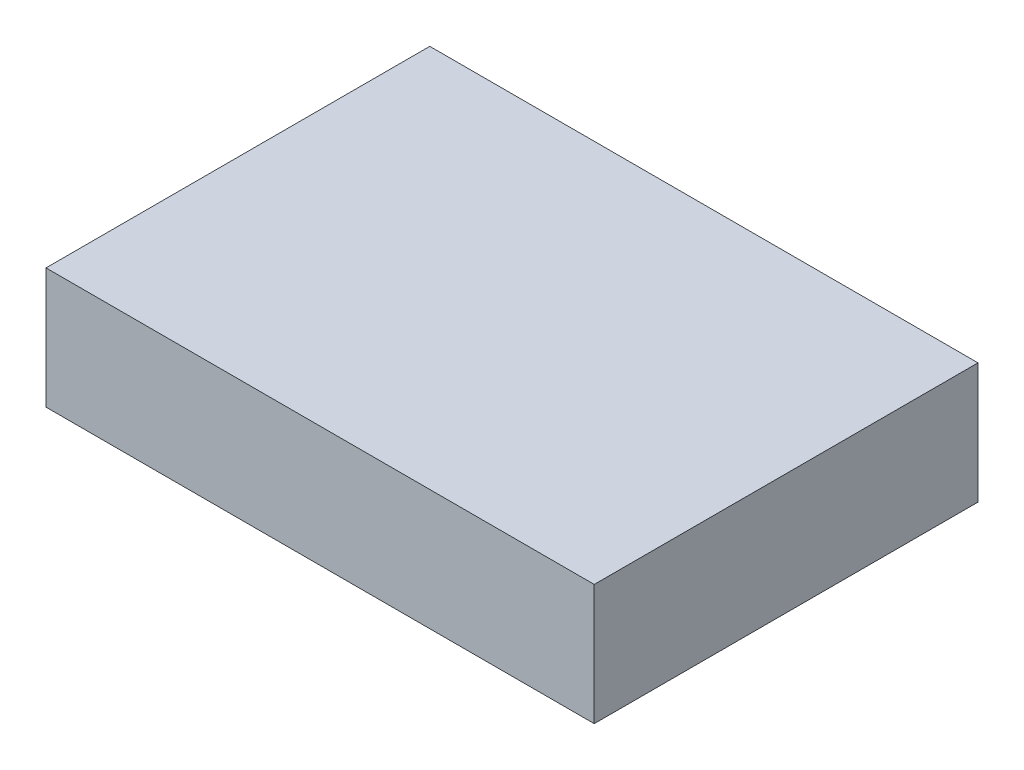
ISO-10303-21;
HEADER;
FILE_DESCRIPTION(('STEP AP214'),'2;1');
FILE_NAME('part.step','',(''),(''),'','','');
FILE_SCHEMA(('AUTOMOTIVE_DESIGN { 1 0 10303 214 1 1 1 1 }'));
ENDSEC;
DATA;
#1=APPLICATION_CONTEXT('core data for automotive mechanical design processes');
#2=APPLICATION_PROTOCOL_DEFINITION('international standard','automotive_design',2000,#1);
#3=PRODUCT_CONTEXT('',#1,'mechanical');
#4=PRODUCT('Part','Part','',(#3));
#5=PRODUCT_RELATED_PRODUCT_CATEGORY('part','',(#4));
#6=PRODUCT_DEFINITION_FORMATION('','',#4);
#7=PRODUCT_DEFINITION_CONTEXT('part definition',#1,'design');
#8=PRODUCT_DEFINITION('design','',#6,#7);
#9=PRODUCT_DEFINITION_SHAPE('','',#8);
#10=(LENGTH_UNIT() NAMED_UNIT(*) SI_UNIT(.MILLI.,.METRE.));
#11=(NAMED_UNIT(*) PLANE_ANGLE_UNIT() SI_UNIT($,.RADIAN.));
#12=(NAMED_UNIT(*) SI_UNIT($,.STERADIAN.) SOLID_ANGLE_UNIT());
#13=UNCERTAINTY_MEASURE_WITH_UNIT(LENGTH_MEASURE(1.E-05),#10,'distance_accuracy_value','');
#14=(GEOMETRIC_REPRESENTATION_CONTEXT(3) GLOBAL_UNCERTAINTY_ASSIGNED_CONTEXT((#13)) GLOBAL_UNIT_ASSIGNED_CONTEXT((#10,
#11,#12)) REPRESENTATION_CONTEXT('',''));
#15=CARTESIAN_POINT('',(0.,0.,0.));
#16=DIRECTION('',(0.,0.,1.));
#17=DIRECTION('',(1.,0.,0.));
#18=AXIS2_PLACEMENT_3D('',#15,#16,#17);
#19=CARTESIAN_POINT('',(-34.2523178699718,11.,-17.005122858167));
#20=DIRECTION('',(1.,0.,0.));
#21=DIRECTION('',(0.,0.,-1.));
#22=AXIS2_PLACEMENT_3D('',#19,#20,#21);
#23=PLANE('',#22);
#24=DIRECTION('',(0.,0.,1.));
#25=VECTOR('',#24,1.);
#26=CARTESIAN_POINT('',(-34.2523178699718,0.,-17.005122858167));
#27=LINE('',#26,#25);
#28=CARTESIAN_POINT('',(-34.2523178699718,0.,-17.005122858167));
#29=VERTEX_POINT('',#28);
#30=CARTESIAN_POINT('',(-34.2523178699718,0.,17.994877141833));
#31=VERTEX_POINT('',#30);
#32=EDGE_CURVE('E110',#29,#31,#27,.T.);
#33=ORIENTED_EDGE('',*,*,#32,.T.);
#34=DIRECTION('',(0.,-1.,0.));
#35=VECTOR('',#34,1.);
#36=CARTESIAN_POINT('',(-34.2523178699718,11.,17.994877141833));
#37=LINE('',#36,#35);
#38=CARTESIAN_POINT('',(-34.2523178699718,11.,17.994877141833));
#39=VERTEX_POINT('',#38);
#40=EDGE_CURVE('E11',#39,#31,#37,.T.);
#41=ORIENTED_EDGE('',*,*,#40,.F.);
#42=DIRECTION('',(0.,0.,1.));
#43=VECTOR('',#42,1.);
#44=CARTESIAN_POINT('',(-34.2523178699718,11.,-17.005122858167));
#45=LINE('',#44,#43);
#46=CARTESIAN_POINT('',(-34.2523178699718,11.,-17.005122858167));
#47=VERTEX_POINT('',#46);
#48=EDGE_CURVE('E94',#47,#39,#45,.T.);
#49=ORIENTED_EDGE('',*,*,#48,.F.);
#50=DIRECTION('',(0.,-1.,0.));
#51=VECTOR('',#50,1.);
#52=CARTESIAN_POINT('',(-34.2523178699718,11.,-17.005122858167));
#53=LINE('',#52,#51);
#54=EDGE_CURVE('E106',#47,#29,#53,.T.);
#55=ORIENTED_EDGE('',*,*,#54,.T.);
#56=EDGE_LOOP('',(#33,#41,#49,#55));
#57=FACE_BOUND('',#56,.T.);
#58=ADVANCED_FACE('F42',(#57),#23,.F.);
#59=CARTESIAN_POINT('',(-34.2523178699718,11.,17.994877141833));
#60=DIRECTION('',(0.,0.,-1.));
#61=DIRECTION('',(-1.,0.,0.));
#62=AXIS2_PLACEMENT_3D('',#59,#60,#61);
#63=PLANE('',#62);
#64=DIRECTION('',(1.,0.,0.));
#65=VECTOR('',#64,1.);
#66=CARTESIAN_POINT('',(-34.2523178699718,0.,17.994877141833));
#67=LINE('',#66,#65);
#68=CARTESIAN_POINT('',(15.7476821300282,0.,17.994877141833));
#69=VERTEX_POINT('',#68);
#70=EDGE_CURVE('E99',#31,#69,#67,.T.);
#71=ORIENTED_EDGE('',*,*,#70,.T.);
#72=DIRECTION('',(0.,-1.,0.));
#73=VECTOR('',#72,1.);
#74=CARTESIAN_POINT('',(15.7476821300282,11.,17.994877141833));
#75=LINE('',#74,#73);
#76=CARTESIAN_POINT('',(15.7476821300282,11.,17.994877141833));
#77=VERTEX_POINT('',#76);
#78=EDGE_CURVE('E51',#77,#69,#75,.T.);
#79=ORIENTED_EDGE('',*,*,#78,.F.);
#80=DIRECTION('',(1.,0.,0.));
#81=VECTOR('',#80,1.);
#82=CARTESIAN_POINT('',(-34.2523178699718,11.,17.994877141833));
#83=LINE('',#82,#81);
#84=EDGE_CURVE('E89',#39,#77,#83,.T.);
#85=ORIENTED_EDGE('',*,*,#84,.F.);
#86=ORIENTED_EDGE('',*,*,#40,.T.);
#87=EDGE_LOOP('',(#71,#79,#85,#86));
#88=FACE_BOUND('',#87,.T.);
#89=ADVANCED_FACE('F98',(#88),#63,.F.);
#90=CARTESIAN_POINT('',(15.7476821300282,11.,-17.005122858167));
#91=DIRECTION('',(-1.,0.,0.));
#92=DIRECTION('',(0.,0.,1.));
#93=AXIS2_PLACEMENT_3D('',#90,#91,#92);
#94=PLANE('',#93);
#95=DIRECTION('',(0.,0.,-1.));
#96=VECTOR('',#95,1.);
#97=CARTESIAN_POINT('',(15.7476821300282,0.,-17.005122858167));
#98=LINE('',#97,#96);
#99=CARTESIAN_POINT('',(15.7476821300282,0.,-17.005122858167));
#100=VERTEX_POINT('',#99);
#101=EDGE_CURVE('E76',#69,#100,#98,.T.);
#102=ORIENTED_EDGE('',*,*,#101,.T.);
#103=DIRECTION('',(0.,-1.,0.));
#104=VECTOR('',#103,1.);
#105=CARTESIAN_POINT('',(15.7476821300282,11.,-17.005122858167));
#106=LINE('',#105,#104);
#107=CARTESIAN_POINT('',(15.7476821300282,11.,-17.005122858167));
#108=VERTEX_POINT('',#107);
#109=EDGE_CURVE('E101',#108,#100,#106,.T.);
#110=ORIENTED_EDGE('',*,*,#109,.F.);
#111=DIRECTION('',(0.,0.,-1.));
#112=VECTOR('',#111,1.);
#113=CARTESIAN_POINT('',(15.7476821300282,11.,-17.005122858167));
#114=LINE('',#113,#112);
#115=EDGE_CURVE('E92',#77,#108,#114,.T.);
#116=ORIENTED_EDGE('',*,*,#115,.F.);
#117=ORIENTED_EDGE('',*,*,#78,.T.);
#118=EDGE_LOOP('',(#102,#110,#116,#117));
#119=FACE_BOUND('',#118,.T.);
#120=ADVANCED_FACE('F102',(#119),#94,.F.);
#121=CARTESIAN_POINT('',(-34.2523178699718,11.,-17.005122858167));
#122=DIRECTION('',(0.,0.,1.));
#123=DIRECTION('',(1.,0.,0.));
#124=AXIS2_PLACEMENT_3D('',#121,#122,#123);
#125=PLANE('',#124);
#126=DIRECTION('',(-1.,0.,0.));
#127=VECTOR('',#126,1.);
#128=CARTESIAN_POINT('',(-34.2523178699718,0.,-17.005122858167));
#129=LINE('',#128,#127);
#130=EDGE_CURVE('E82',#100,#29,#129,.T.);
#131=ORIENTED_EDGE('',*,*,#130,.T.);
#132=ORIENTED_EDGE('',*,*,#54,.F.);
#133=DIRECTION('',(-1.,0.,0.));
#134=VECTOR('',#133,1.);
#135=CARTESIAN_POINT('',(-34.2523178699718,11.,-17.005122858167));
#136=LINE('',#135,#134);
#137=EDGE_CURVE('E59',#108,#47,#136,.T.);
#138=ORIENTED_EDGE('',*,*,#137,.F.);
#139=ORIENTED_EDGE('',*,*,#109,.T.);
#140=EDGE_LOOP('',(#131,#132,#138,#139));
#141=FACE_BOUND('',#140,.T.);
#142=ADVANCED_FACE('F123',(#141),#125,.F.);
#143=CARTESIAN_POINT('',(0.,11.,0.));
#144=DIRECTION('',(0.,1.,0.));
#145=DIRECTION('',(0.,0.,1.));
#146=AXIS2_PLACEMENT_3D('',#143,#144,#145);
#147=PLANE('',#146);
#148=ORIENTED_EDGE('',*,*,#48,.T.);
#149=ORIENTED_EDGE('',*,*,#84,.T.);
#150=ORIENTED_EDGE('',*,*,#115,.T.);
#151=ORIENTED_EDGE('',*,*,#137,.T.);
#152=EDGE_LOOP('',(#148,#149,#150,#151));
#153=FACE_BOUND('',#152,.T.);
#154=ADVANCED_FACE('F90',(#153),#147,.T.);
#155=CARTESIAN_POINT('',(0.,0.,0.));
#156=DIRECTION('',(0.,1.,0.));
#157=DIRECTION('',(0.,0.,1.));
#158=AXIS2_PLACEMENT_3D('',#155,#156,#157);
#159=PLANE('',#158);
#160=ORIENTED_EDGE('',*,*,#32,.F.);
#161=ORIENTED_EDGE('',*,*,#130,.F.);
#162=ORIENTED_EDGE('',*,*,#101,.F.);
#163=ORIENTED_EDGE('',*,*,#70,.F.);
#164=EDGE_LOOP('',(#160,#161,#162,#163));
#165=FACE_BOUND('',#164,.T.);
#166=ADVANCED_FACE('F126',(#165),#159,.F.);
#167=CLOSED_SHELL('',(#58,#89,#120,#142,#154,#166));
#168=MANIFOLD_SOLID_BREP('B2',#167);
#169=ADVANCED_BREP_SHAPE_REPRESENTATION('',(#18,#168),#14);
#170=SHAPE_DEFINITION_REPRESENTATION(#9,#169);
ENDSEC;
END-ISO-10303-21;
